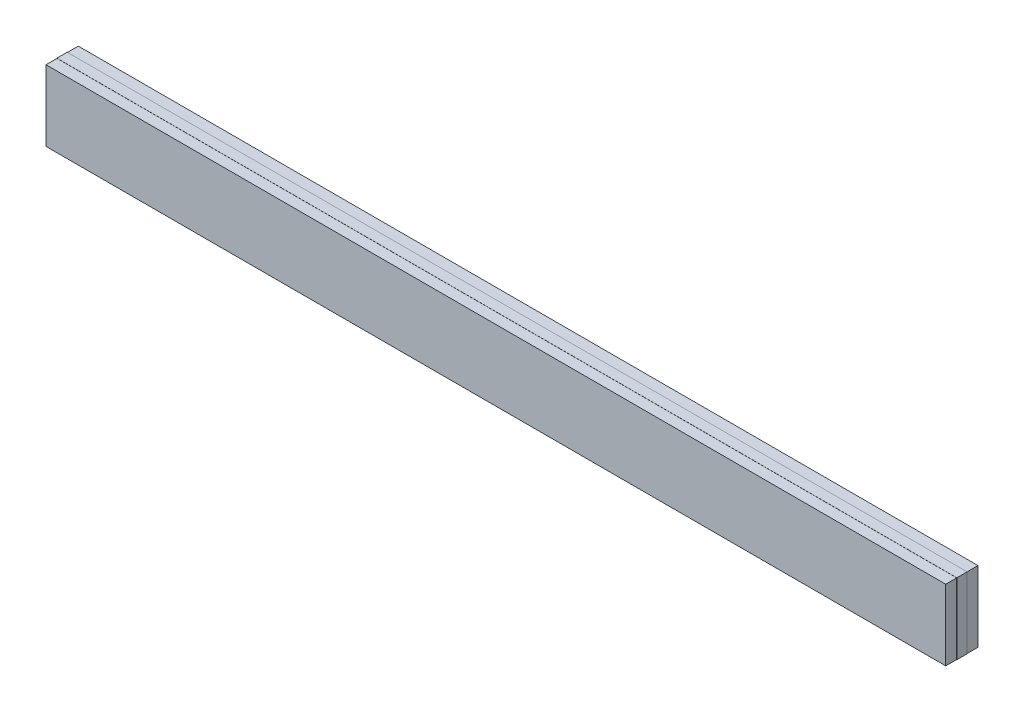
ISO-10303-21;
HEADER;
FILE_DESCRIPTION(('STEP AP214'),'2;1');
FILE_NAME('part.step','',(''),(''),'','','');
FILE_SCHEMA(('AUTOMOTIVE_DESIGN { 1 0 10303 214 1 1 1 1 }'));
ENDSEC;
DATA;
#1=APPLICATION_CONTEXT('core data for automotive mechanical design processes');
#2=APPLICATION_PROTOCOL_DEFINITION('international standard','automotive_design',2000,#1);
#3=PRODUCT_CONTEXT('',#1,'mechanical');
#4=PRODUCT('Part','Part','',(#3));
#5=PRODUCT_RELATED_PRODUCT_CATEGORY('part','',(#4));
#6=PRODUCT_DEFINITION_FORMATION('','',#4);
#7=PRODUCT_DEFINITION_CONTEXT('part definition',#1,'design');
#8=PRODUCT_DEFINITION('design','',#6,#7);
#9=PRODUCT_DEFINITION_SHAPE('','',#8);
#10=(LENGTH_UNIT() NAMED_UNIT(*) SI_UNIT(.MILLI.,.METRE.));
#11=(NAMED_UNIT(*) PLANE_ANGLE_UNIT() SI_UNIT($,.RADIAN.));
#12=(NAMED_UNIT(*) SI_UNIT($,.STERADIAN.) SOLID_ANGLE_UNIT());
#13=UNCERTAINTY_MEASURE_WITH_UNIT(LENGTH_MEASURE(1.E-05),#10,'distance_accuracy_value','');
#14=(GEOMETRIC_REPRESENTATION_CONTEXT(3) GLOBAL_UNCERTAINTY_ASSIGNED_CONTEXT((#13)) GLOBAL_UNIT_ASSIGNED_CONTEXT((#10,
#11,#12)) REPRESENTATION_CONTEXT('',''));
#15=CARTESIAN_POINT('',(0.,0.,0.));
#16=DIRECTION('',(0.,0.,1.));
#17=DIRECTION('',(1.,0.,0.));
#18=AXIS2_PLACEMENT_3D('',#15,#16,#17);
#19=CARTESIAN_POINT('',(0.,0.,-0.4));
#20=DIRECTION('',(0.,0.,1.));
#21=DIRECTION('',(1.,0.,0.));
#22=AXIS2_PLACEMENT_3D('',#19,#20,#21);
#23=PLANE('',#22);
#24=DIRECTION('',(0.,1.,0.));
#25=VECTOR('',#24,1.);
#26=CARTESIAN_POINT('',(34.85,2.75,-0.4));
#27=LINE('',#26,#25);
#28=CARTESIAN_POINT('',(34.85,-2.75,-0.4));
#29=VERTEX_POINT('',#28);
#30=CARTESIAN_POINT('',(34.85,2.75,-0.4));
#31=VERTEX_POINT('',#30);
#32=EDGE_CURVE('E176',#29,#31,#27,.T.);
#33=ORIENTED_EDGE('',*,*,#32,.F.);
#34=DIRECTION('',(1.,0.,0.));
#35=VECTOR('',#34,1.);
#36=CARTESIAN_POINT('',(-34.85,-2.75,-0.4));
#37=LINE('',#36,#35);
#38=CARTESIAN_POINT('',(-34.85,-2.75,-0.4));
#39=VERTEX_POINT('',#38);
#40=EDGE_CURVE('E181',#39,#29,#37,.T.);
#41=ORIENTED_EDGE('',*,*,#40,.F.);
#42=DIRECTION('',(0.,-1.,0.));
#43=VECTOR('',#42,1.);
#44=CARTESIAN_POINT('',(-34.85,2.75,-0.4));
#45=LINE('',#44,#43);
#46=CARTESIAN_POINT('',(-34.85,2.75,-0.4));
#47=VERTEX_POINT('',#46);
#48=EDGE_CURVE('E192',#47,#39,#45,.T.);
#49=ORIENTED_EDGE('',*,*,#48,.F.);
#50=DIRECTION('',(-1.,0.,0.));
#51=VECTOR('',#50,1.);
#52=CARTESIAN_POINT('',(-34.85,2.75,-0.4));
#53=LINE('',#52,#51);
#54=EDGE_CURVE('E190',#31,#47,#53,.T.);
#55=ORIENTED_EDGE('',*,*,#54,.F.);
#56=EDGE_LOOP('',(#33,#41,#49,#55));
#57=FACE_BOUND('',#56,.T.);
#58=DIRECTION('',(1.,0.,0.));
#59=VECTOR('',#58,1.);
#60=CARTESIAN_POINT('',(-34.84,2.74,-0.4));
#61=LINE('',#60,#59);
#62=CARTESIAN_POINT('',(-34.84,2.74,-0.4));
#63=VERTEX_POINT('',#62);
#64=CARTESIAN_POINT('',(34.84,2.74,-0.4));
#65=VERTEX_POINT('',#64);
#66=EDGE_CURVE('E141',#63,#65,#61,.T.);
#67=ORIENTED_EDGE('',*,*,#66,.F.);
#68=DIRECTION('',(0.,1.,0.));
#69=VECTOR('',#68,1.);
#70=CARTESIAN_POINT('',(-34.84,-2.74,-0.4));
#71=LINE('',#70,#69);
#72=CARTESIAN_POINT('',(-34.84,-2.74,-0.4));
#73=VERTEX_POINT('',#72);
#74=EDGE_CURVE('E138',#73,#63,#71,.T.);
#75=ORIENTED_EDGE('',*,*,#74,.F.);
#76=DIRECTION('',(-1.,0.,0.));
#77=VECTOR('',#76,1.);
#78=CARTESIAN_POINT('',(34.84,-2.74,-0.4));
#79=LINE('',#78,#77);
#80=CARTESIAN_POINT('',(34.84,-2.74,-0.4));
#81=VERTEX_POINT('',#80);
#82=EDGE_CURVE('E52',#81,#73,#79,.T.);
#83=ORIENTED_EDGE('',*,*,#82,.F.);
#84=DIRECTION('',(0.,-1.,0.));
#85=VECTOR('',#84,1.);
#86=CARTESIAN_POINT('',(34.84,2.74,-0.4));
#87=LINE('',#86,#85);
#88=EDGE_CURVE('E47',#65,#81,#87,.T.);
#89=ORIENTED_EDGE('',*,*,#88,.F.);
#90=EDGE_LOOP('',(#67,#75,#83,#89));
#91=FACE_BOUND('',#90,.T.);
#92=ADVANCED_FACE('F32',(#57,#91),#23,.F.);
#93=CARTESIAN_POINT('',(0.,0.,0.4));
#94=DIRECTION('',(0.,0.,1.));
#95=DIRECTION('',(1.,0.,0.));
#96=AXIS2_PLACEMENT_3D('',#93,#94,#95);
#97=PLANE('',#96);
#98=DIRECTION('',(0.,1.,0.));
#99=VECTOR('',#98,1.);
#100=CARTESIAN_POINT('',(34.85,2.75,0.4));
#101=LINE('',#100,#99);
#102=CARTESIAN_POINT('',(34.85,-2.75,0.4));
#103=VERTEX_POINT('',#102);
#104=CARTESIAN_POINT('',(34.85,2.75,0.4));
#105=VERTEX_POINT('',#104);
#106=EDGE_CURVE('E177',#103,#105,#101,.T.);
#107=ORIENTED_EDGE('',*,*,#106,.T.);
#108=DIRECTION('',(-1.,0.,0.));
#109=VECTOR('',#108,1.);
#110=CARTESIAN_POINT('',(-34.85,2.75,0.4));
#111=LINE('',#110,#109);
#112=CARTESIAN_POINT('',(-34.85,2.75,0.4));
#113=VERTEX_POINT('',#112);
#114=EDGE_CURVE('E180',#105,#113,#111,.T.);
#115=ORIENTED_EDGE('',*,*,#114,.T.);
#116=DIRECTION('',(0.,-1.,0.));
#117=VECTOR('',#116,1.);
#118=CARTESIAN_POINT('',(-34.85,2.75,0.4));
#119=LINE('',#118,#117);
#120=CARTESIAN_POINT('',(-34.85,-2.75,0.4));
#121=VERTEX_POINT('',#120);
#122=EDGE_CURVE('E183',#113,#121,#119,.T.);
#123=ORIENTED_EDGE('',*,*,#122,.T.);
#124=DIRECTION('',(1.,0.,0.));
#125=VECTOR('',#124,1.);
#126=CARTESIAN_POINT('',(-34.85,-2.75,0.4));
#127=LINE('',#126,#125);
#128=EDGE_CURVE('E185',#121,#103,#127,.T.);
#129=ORIENTED_EDGE('',*,*,#128,.T.);
#130=EDGE_LOOP('',(#107,#115,#123,#129));
#131=FACE_BOUND('',#130,.T.);
#132=DIRECTION('',(0.,1.,0.));
#133=VECTOR('',#132,1.);
#134=CARTESIAN_POINT('',(34.84,-2.74,0.4));
#135=LINE('',#134,#133);
#136=CARTESIAN_POINT('',(34.84,-2.74,0.4));
#137=VERTEX_POINT('',#136);
#138=CARTESIAN_POINT('',(34.84,2.74,0.4));
#139=VERTEX_POINT('',#138);
#140=EDGE_CURVE('E145',#137,#139,#135,.T.);
#141=ORIENTED_EDGE('',*,*,#140,.F.);
#142=DIRECTION('',(1.,0.,0.));
#143=VECTOR('',#142,1.);
#144=CARTESIAN_POINT('',(-34.84,-2.74,0.4));
#145=LINE('',#144,#143);
#146=CARTESIAN_POINT('',(-34.84,-2.74,0.4));
#147=VERTEX_POINT('',#146);
#148=EDGE_CURVE('E142',#147,#137,#145,.T.);
#149=ORIENTED_EDGE('',*,*,#148,.F.);
#150=DIRECTION('',(0.,-1.,0.));
#151=VECTOR('',#150,1.);
#152=CARTESIAN_POINT('',(-34.84,2.74,0.4));
#153=LINE('',#152,#151);
#154=CARTESIAN_POINT('',(-34.84,2.74,0.4));
#155=VERTEX_POINT('',#154);
#156=EDGE_CURVE('E155',#155,#147,#153,.T.);
#157=ORIENTED_EDGE('',*,*,#156,.F.);
#158=DIRECTION('',(-1.,0.,0.));
#159=VECTOR('',#158,1.);
#160=CARTESIAN_POINT('',(34.84,2.74,0.4));
#161=LINE('',#160,#159);
#162=EDGE_CURVE('E163',#139,#155,#161,.T.);
#163=ORIENTED_EDGE('',*,*,#162,.F.);
#164=EDGE_LOOP('',(#141,#149,#157,#163));
#165=FACE_BOUND('',#164,.T.);
#166=ADVANCED_FACE('F218',(#131,#165),#97,.T.);
#167=CARTESIAN_POINT('',(34.85,2.75,0.4));
#168=DIRECTION('',(-1.,0.,0.));
#169=DIRECTION('',(0.,0.,1.));
#170=AXIS2_PLACEMENT_3D('',#167,#168,#169);
#171=PLANE('',#170);
#172=ORIENTED_EDGE('',*,*,#32,.T.);
#173=DIRECTION('',(0.,0.,-1.));
#174=VECTOR('',#173,1.);
#175=CARTESIAN_POINT('',(34.85,2.75,0.4));
#176=LINE('',#175,#174);
#177=EDGE_CURVE('E11',#105,#31,#176,.T.);
#178=ORIENTED_EDGE('',*,*,#177,.F.);
#179=ORIENTED_EDGE('',*,*,#106,.F.);
#180=DIRECTION('',(0.,0.,-1.));
#181=VECTOR('',#180,1.);
#182=CARTESIAN_POINT('',(34.85,-2.75,0.4));
#183=LINE('',#182,#181);
#184=EDGE_CURVE('E187',#103,#29,#183,.T.);
#185=ORIENTED_EDGE('',*,*,#184,.T.);
#186=EDGE_LOOP('',(#172,#178,#179,#185));
#187=FACE_BOUND('',#186,.T.);
#188=ADVANCED_FACE('F34',(#187),#171,.F.);
#189=CARTESIAN_POINT('',(-34.85,2.75,0.4));
#190=DIRECTION('',(0.,-1.,0.));
#191=DIRECTION('',(0.,0.,-1.));
#192=AXIS2_PLACEMENT_3D('',#189,#190,#191);
#193=PLANE('',#192);
#194=ORIENTED_EDGE('',*,*,#54,.T.);
#195=DIRECTION('',(0.,0.,-1.));
#196=VECTOR('',#195,1.);
#197=CARTESIAN_POINT('',(-34.85,2.75,0.4));
#198=LINE('',#197,#196);
#199=EDGE_CURVE('E40',#113,#47,#198,.T.);
#200=ORIENTED_EDGE('',*,*,#199,.F.);
#201=ORIENTED_EDGE('',*,*,#114,.F.);
#202=ORIENTED_EDGE('',*,*,#177,.T.);
#203=EDGE_LOOP('',(#194,#200,#201,#202));
#204=FACE_BOUND('',#203,.T.);
#205=ADVANCED_FACE('F220',(#204),#193,.F.);
#206=CARTESIAN_POINT('',(-34.85,2.75,0.4));
#207=DIRECTION('',(1.,0.,0.));
#208=DIRECTION('',(0.,0.,-1.));
#209=AXIS2_PLACEMENT_3D('',#206,#207,#208);
#210=PLANE('',#209);
#211=ORIENTED_EDGE('',*,*,#48,.T.);
#212=DIRECTION('',(0.,0.,-1.));
#213=VECTOR('',#212,1.);
#214=CARTESIAN_POINT('',(-34.85,-2.75,0.4));
#215=LINE('',#214,#213);
#216=EDGE_CURVE('E197',#121,#39,#215,.T.);
#217=ORIENTED_EDGE('',*,*,#216,.F.);
#218=ORIENTED_EDGE('',*,*,#122,.F.);
#219=ORIENTED_EDGE('',*,*,#199,.T.);
#220=EDGE_LOOP('',(#211,#217,#218,#219));
#221=FACE_BOUND('',#220,.T.);
#222=ADVANCED_FACE('F204',(#221),#210,.F.);
#223=CARTESIAN_POINT('',(-34.85,-2.75,0.4));
#224=DIRECTION('',(0.,1.,0.));
#225=DIRECTION('',(0.,0.,1.));
#226=AXIS2_PLACEMENT_3D('',#223,#224,#225);
#227=PLANE('',#226);
#228=ORIENTED_EDGE('',*,*,#40,.T.);
#229=ORIENTED_EDGE('',*,*,#184,.F.);
#230=ORIENTED_EDGE('',*,*,#128,.F.);
#231=ORIENTED_EDGE('',*,*,#216,.T.);
#232=EDGE_LOOP('',(#228,#229,#230,#231));
#233=FACE_BOUND('',#232,.T.);
#234=ADVANCED_FACE('F212',(#233),#227,.F.);
#235=CARTESIAN_POINT('',(-34.84,-2.74,1.25));
#236=DIRECTION('',(0.,1.,0.));
#237=DIRECTION('',(0.,0.,1.));
#238=AXIS2_PLACEMENT_3D('',#235,#236,#237);
#239=PLANE('',#238);
#240=ORIENTED_EDGE('',*,*,#148,.T.);
#241=DIRECTION('',(0.,0.,-1.));
#242=VECTOR('',#241,1.);
#243=CARTESIAN_POINT('',(34.84,-2.74,1.25));
#244=LINE('',#243,#242);
#245=CARTESIAN_POINT('',(34.84,-2.74,1.25));
#246=VERTEX_POINT('',#245);
#247=EDGE_CURVE('E174',#246,#137,#244,.T.);
#248=ORIENTED_EDGE('',*,*,#247,.F.);
#249=DIRECTION('',(1.,0.,0.));
#250=VECTOR('',#249,1.);
#251=CARTESIAN_POINT('',(-34.84,-2.74,1.25));
#252=LINE('',#251,#250);
#253=CARTESIAN_POINT('',(-34.84,-2.74,1.25));
#254=VERTEX_POINT('',#253);
#255=EDGE_CURVE('E151',#254,#246,#252,.T.);
#256=ORIENTED_EDGE('',*,*,#255,.F.);
#257=DIRECTION('',(0.,0.,-1.));
#258=VECTOR('',#257,1.);
#259=CARTESIAN_POINT('',(-34.84,-2.74,1.25));
#260=LINE('',#259,#258);
#261=EDGE_CURVE('E160',#254,#147,#260,.T.);
#262=ORIENTED_EDGE('',*,*,#261,.T.);
#263=EDGE_LOOP('',(#240,#248,#256,#262));
#264=FACE_BOUND('',#263,.T.);
#265=ADVANCED_FACE('F236',(#264),#239,.F.);
#266=CARTESIAN_POINT('',(34.84,-2.74,1.25));
#267=DIRECTION('',(-1.,0.,0.));
#268=DIRECTION('',(0.,0.,1.));
#269=AXIS2_PLACEMENT_3D('',#266,#267,#268);
#270=PLANE('',#269);
#271=ORIENTED_EDGE('',*,*,#140,.T.);
#272=DIRECTION('',(0.,0.,-1.));
#273=VECTOR('',#272,1.);
#274=CARTESIAN_POINT('',(34.84,2.74,1.25));
#275=LINE('',#274,#273);
#276=CARTESIAN_POINT('',(34.84,2.74,1.25));
#277=VERTEX_POINT('',#276);
#278=EDGE_CURVE('E171',#277,#139,#275,.T.);
#279=ORIENTED_EDGE('',*,*,#278,.F.);
#280=DIRECTION('',(0.,1.,0.));
#281=VECTOR('',#280,1.);
#282=CARTESIAN_POINT('',(34.84,-2.74,1.25));
#283=LINE('',#282,#281);
#284=EDGE_CURVE('E154',#246,#277,#283,.T.);
#285=ORIENTED_EDGE('',*,*,#284,.F.);
#286=ORIENTED_EDGE('',*,*,#247,.T.);
#287=EDGE_LOOP('',(#271,#279,#285,#286));
#288=FACE_BOUND('',#287,.T.);
#289=ADVANCED_FACE('F240',(#288),#270,.F.);
#290=CARTESIAN_POINT('',(34.84,2.74,1.25));
#291=DIRECTION('',(0.,-1.,0.));
#292=DIRECTION('',(0.,0.,-1.));
#293=AXIS2_PLACEMENT_3D('',#290,#291,#292);
#294=PLANE('',#293);
#295=ORIENTED_EDGE('',*,*,#162,.T.);
#296=DIRECTION('',(0.,0.,-1.));
#297=VECTOR('',#296,1.);
#298=CARTESIAN_POINT('',(-34.84,2.74,1.25));
#299=LINE('',#298,#297);
#300=CARTESIAN_POINT('',(-34.84,2.74,1.25));
#301=VERTEX_POINT('',#300);
#302=EDGE_CURVE('E169',#301,#155,#299,.T.);
#303=ORIENTED_EDGE('',*,*,#302,.F.);
#304=DIRECTION('',(-1.,0.,0.));
#305=VECTOR('',#304,1.);
#306=CARTESIAN_POINT('',(34.84,2.74,1.25));
#307=LINE('',#306,#305);
#308=EDGE_CURVE('E157',#277,#301,#307,.T.);
#309=ORIENTED_EDGE('',*,*,#308,.F.);
#310=ORIENTED_EDGE('',*,*,#278,.T.);
#311=EDGE_LOOP('',(#295,#303,#309,#310));
#312=FACE_BOUND('',#311,.T.);
#313=ADVANCED_FACE('F245',(#312),#294,.F.);
#314=CARTESIAN_POINT('',(-34.84,2.74,1.25));
#315=DIRECTION('',(1.,0.,0.));
#316=DIRECTION('',(0.,0.,-1.));
#317=AXIS2_PLACEMENT_3D('',#314,#315,#316);
#318=PLANE('',#317);
#319=ORIENTED_EDGE('',*,*,#156,.T.);
#320=ORIENTED_EDGE('',*,*,#261,.F.);
#321=DIRECTION('',(0.,-1.,0.));
#322=VECTOR('',#321,1.);
#323=CARTESIAN_POINT('',(-34.84,2.74,1.25));
#324=LINE('',#323,#322);
#325=EDGE_CURVE('E159',#301,#254,#324,.T.);
#326=ORIENTED_EDGE('',*,*,#325,.F.);
#327=ORIENTED_EDGE('',*,*,#302,.T.);
#328=EDGE_LOOP('',(#319,#320,#326,#327));
#329=FACE_BOUND('',#328,.T.);
#330=ADVANCED_FACE('F251',(#329),#318,.F.);
#331=CARTESIAN_POINT('',(0.,0.,1.25));
#332=DIRECTION('',(0.,0.,1.));
#333=DIRECTION('',(1.,0.,0.));
#334=AXIS2_PLACEMENT_3D('',#331,#332,#333);
#335=PLANE('',#334);
#336=ORIENTED_EDGE('',*,*,#255,.T.);
#337=ORIENTED_EDGE('',*,*,#284,.T.);
#338=ORIENTED_EDGE('',*,*,#308,.T.);
#339=ORIENTED_EDGE('',*,*,#325,.T.);
#340=EDGE_LOOP('',(#336,#337,#338,#339));
#341=FACE_BOUND('',#340,.T.);
#342=ADVANCED_FACE('F255',(#341),#335,.T.);
#343=CARTESIAN_POINT('',(-34.84,2.74,-1.25));
#344=DIRECTION('',(0.,-1.,0.));
#345=DIRECTION('',(0.,0.,-1.));
#346=AXIS2_PLACEMENT_3D('',#343,#344,#345);
#347=PLANE('',#346);
#348=ORIENTED_EDGE('',*,*,#66,.T.);
#349=DIRECTION('',(0.,0.,1.));
#350=VECTOR('',#349,1.);
#351=CARTESIAN_POINT('',(34.84,2.74,-1.25));
#352=LINE('',#351,#350);
#353=CARTESIAN_POINT('',(34.84,2.74,-1.25));
#354=VERTEX_POINT('',#353);
#355=EDGE_CURVE('E122',#354,#65,#352,.T.);
#356=ORIENTED_EDGE('',*,*,#355,.F.);
#357=DIRECTION('',(1.,0.,0.));
#358=VECTOR('',#357,1.);
#359=CARTESIAN_POINT('',(-34.84,2.74,-1.25));
#360=LINE('',#359,#358);
#361=CARTESIAN_POINT('',(-34.84,2.74,-1.25));
#362=VERTEX_POINT('',#361);
#363=EDGE_CURVE('E129',#362,#354,#360,.T.);
#364=ORIENTED_EDGE('',*,*,#363,.F.);
#365=DIRECTION('',(0.,0.,1.));
#366=VECTOR('',#365,1.);
#367=CARTESIAN_POINT('',(-34.84,2.74,-1.25));
#368=LINE('',#367,#366);
#369=EDGE_CURVE('E363',#362,#63,#368,.T.);
#370=ORIENTED_EDGE('',*,*,#369,.T.);
#371=EDGE_LOOP('',(#348,#356,#364,#370));
#372=FACE_BOUND('',#371,.T.);
#373=ADVANCED_FACE('F140',(#372),#347,.F.);
#374=CARTESIAN_POINT('',(34.84,2.74,-1.25));
#375=DIRECTION('',(-1.,0.,0.));
#376=DIRECTION('',(0.,0.,1.));
#377=AXIS2_PLACEMENT_3D('',#374,#375,#376);
#378=PLANE('',#377);
#379=ORIENTED_EDGE('',*,*,#88,.T.);
#380=DIRECTION('',(0.,0.,1.));
#381=VECTOR('',#380,1.);
#382=CARTESIAN_POINT('',(34.84,-2.74,-1.25));
#383=LINE('',#382,#381);
#384=CARTESIAN_POINT('',(34.84,-2.74,-1.25));
#385=VERTEX_POINT('',#384);
#386=EDGE_CURVE('E125',#385,#81,#383,.T.);
#387=ORIENTED_EDGE('',*,*,#386,.F.);
#388=DIRECTION('',(0.,-1.,0.));
#389=VECTOR('',#388,1.);
#390=CARTESIAN_POINT('',(34.84,2.74,-1.25));
#391=LINE('',#390,#389);
#392=EDGE_CURVE('E118',#354,#385,#391,.T.);
#393=ORIENTED_EDGE('',*,*,#392,.F.);
#394=ORIENTED_EDGE('',*,*,#355,.T.);
#395=EDGE_LOOP('',(#379,#387,#393,#394));
#396=FACE_BOUND('',#395,.T.);
#397=ADVANCED_FACE('F120',(#396),#378,.F.);
#398=CARTESIAN_POINT('',(34.84,-2.74,-1.25));
#399=DIRECTION('',(0.,1.,0.));
#400=DIRECTION('',(0.,0.,1.));
#401=AXIS2_PLACEMENT_3D('',#398,#399,#400);
#402=PLANE('',#401);
#403=ORIENTED_EDGE('',*,*,#82,.T.);
#404=DIRECTION('',(0.,0.,1.));
#405=VECTOR('',#404,1.);
#406=CARTESIAN_POINT('',(-34.84,-2.74,-1.25));
#407=LINE('',#406,#405);
#408=CARTESIAN_POINT('',(-34.84,-2.74,-1.25));
#409=VERTEX_POINT('',#408);
#410=EDGE_CURVE('E147',#409,#73,#407,.T.);
#411=ORIENTED_EDGE('',*,*,#410,.F.);
#412=DIRECTION('',(-1.,0.,0.));
#413=VECTOR('',#412,1.);
#414=CARTESIAN_POINT('',(34.84,-2.74,-1.25));
#415=LINE('',#414,#413);
#416=EDGE_CURVE('E128',#385,#409,#415,.T.);
#417=ORIENTED_EDGE('',*,*,#416,.F.);
#418=ORIENTED_EDGE('',*,*,#386,.T.);
#419=EDGE_LOOP('',(#403,#411,#417,#418));
#420=FACE_BOUND('',#419,.T.);
#421=ADVANCED_FACE('F264',(#420),#402,.F.);
#422=CARTESIAN_POINT('',(-34.84,-2.74,-1.25));
#423=DIRECTION('',(1.,0.,0.));
#424=DIRECTION('',(0.,0.,-1.));
#425=AXIS2_PLACEMENT_3D('',#422,#423,#424);
#426=PLANE('',#425);
#427=ORIENTED_EDGE('',*,*,#74,.T.);
#428=ORIENTED_EDGE('',*,*,#369,.F.);
#429=DIRECTION('',(0.,1.,0.));
#430=VECTOR('',#429,1.);
#431=CARTESIAN_POINT('',(-34.84,-2.74,-1.25));
#432=LINE('',#431,#430);
#433=EDGE_CURVE('E134',#409,#362,#432,.T.);
#434=ORIENTED_EDGE('',*,*,#433,.F.);
#435=ORIENTED_EDGE('',*,*,#410,.T.);
#436=EDGE_LOOP('',(#427,#428,#434,#435));
#437=FACE_BOUND('',#436,.T.);
#438=ADVANCED_FACE('F267',(#437),#426,.F.);
#439=CARTESIAN_POINT('',(0.,0.,-1.25));
#440=DIRECTION('',(0.,0.,-1.));
#441=DIRECTION('',(-1.,0.,0.));
#442=AXIS2_PLACEMENT_3D('',#439,#440,#441);
#443=PLANE('',#442);
#444=ORIENTED_EDGE('',*,*,#363,.T.);
#445=ORIENTED_EDGE('',*,*,#392,.T.);
#446=ORIENTED_EDGE('',*,*,#416,.T.);
#447=ORIENTED_EDGE('',*,*,#433,.T.);
#448=EDGE_LOOP('',(#444,#445,#446,#447));
#449=FACE_BOUND('',#448,.T.);
#450=ADVANCED_FACE('F132',(#449),#443,.T.);
#451=CLOSED_SHELL('',(#92,#166,#188,#205,#222,#234,#265,#289,#313,#330,#342,#373,#397,#421,#438,#450));
#452=MANIFOLD_SOLID_BREP('B2',#451);
#453=ADVANCED_BREP_SHAPE_REPRESENTATION('',(#18,#452),#14);
#454=SHAPE_DEFINITION_REPRESENTATION(#9,#453);
ENDSEC;
END-ISO-10303-21;
